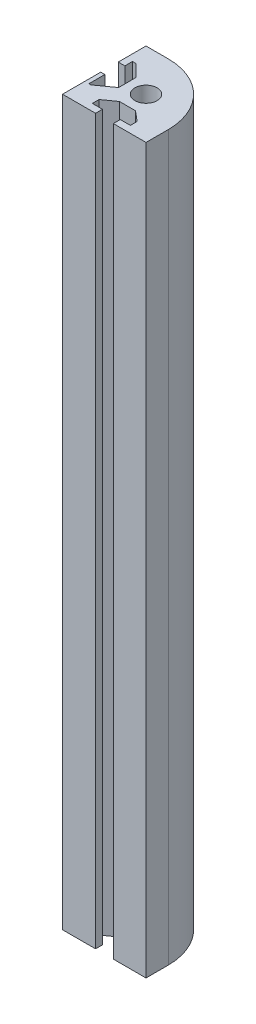
ISO-10303-21;
HEADER;
FILE_DESCRIPTION(('STEP AP214'),'2;1');
FILE_NAME('part.step','',(''),(''),'','','');
FILE_SCHEMA(('AUTOMOTIVE_DESIGN { 1 0 10303 214 1 1 1 1 }'));
ENDSEC;
DATA;
#1=APPLICATION_CONTEXT('core data for automotive mechanical design processes');
#2=APPLICATION_PROTOCOL_DEFINITION('international standard','automotive_design',2000,#1);
#3=PRODUCT_CONTEXT('',#1,'mechanical');
#4=PRODUCT('Part','Part','',(#3));
#5=PRODUCT_RELATED_PRODUCT_CATEGORY('part','',(#4));
#6=PRODUCT_DEFINITION_FORMATION('','',#4);
#7=PRODUCT_DEFINITION_CONTEXT('part definition',#1,'design');
#8=PRODUCT_DEFINITION('design','',#6,#7);
#9=PRODUCT_DEFINITION_SHAPE('','',#8);
#10=(LENGTH_UNIT() NAMED_UNIT(*) SI_UNIT(.MILLI.,.METRE.));
#11=(NAMED_UNIT(*) PLANE_ANGLE_UNIT() SI_UNIT($,.RADIAN.));
#12=(NAMED_UNIT(*) SI_UNIT($,.STERADIAN.) SOLID_ANGLE_UNIT());
#13=UNCERTAINTY_MEASURE_WITH_UNIT(LENGTH_MEASURE(1.E-05),#10,'distance_accuracy_value','');
#14=(GEOMETRIC_REPRESENTATION_CONTEXT(3) GLOBAL_UNCERTAINTY_ASSIGNED_CONTEXT((#13)) GLOBAL_UNIT_ASSIGNED_CONTEXT((#10,
#11,#12)) REPRESENTATION_CONTEXT('',''));
#15=CARTESIAN_POINT('',(0.,0.,0.));
#16=DIRECTION('',(0.,0.,1.));
#17=DIRECTION('',(1.,0.,0.));
#18=AXIS2_PLACEMENT_3D('',#15,#16,#17);
#19=CARTESIAN_POINT('',(-7.,260.,7.));
#20=DIRECTION('',(0.,-1.,0.));
#21=DIRECTION('',(0.,0.,-1.));
#22=AXIS2_PLACEMENT_3D('',#19,#20,#21);
#23=PLANE('',#22);
#24=DIRECTION('',(0.,0.,-1.));
#25=VECTOR('',#24,1.);
#26=CARTESIAN_POINT('',(15.,260.,15.));
#27=LINE('',#26,#25);
#28=CARTESIAN_POINT('',(15.,260.,15.));
#29=VERTEX_POINT('',#28);
#30=CARTESIAN_POINT('',(15.,260.,7.));
#31=VERTEX_POINT('',#30);
#32=EDGE_CURVE('E369',#29,#31,#27,.T.);
#33=ORIENTED_EDGE('',*,*,#32,.T.);
#34=CARTESIAN_POINT('',(-7.,260.,7.));
#35=DIRECTION('',(0.,1.,0.));
#36=DIRECTION('',(0.,0.,-1.));
#37=AXIS2_PLACEMENT_3D('',#34,#35,#36);
#38=CIRCLE('',#37,22.);
#39=CARTESIAN_POINT('',(-7.00000000000001,260.,-15.));
#40=VERTEX_POINT('',#39);
#41=EDGE_CURVE('E181',#31,#40,#38,.T.);
#42=ORIENTED_EDGE('',*,*,#41,.T.);
#43=DIRECTION('',(-1.,0.,0.));
#44=VECTOR('',#43,1.);
#45=CARTESIAN_POINT('',(-7.00000000000001,260.,-15.));
#46=LINE('',#45,#44);
#47=CARTESIAN_POINT('',(-15.,260.,-15.));
#48=VERTEX_POINT('',#47);
#49=EDGE_CURVE('E458',#40,#48,#46,.T.);
#50=ORIENTED_EDGE('',*,*,#49,.T.);
#51=DIRECTION('',(0.,0.,1.));
#52=VECTOR('',#51,1.);
#53=CARTESIAN_POINT('',(-15.,260.,-15.));
#54=LINE('',#53,#52);
#55=CARTESIAN_POINT('',(-15.,260.,-5.02760491674106));
#56=VERTEX_POINT('',#55);
#57=EDGE_CURVE('E478',#48,#56,#54,.T.);
#58=ORIENTED_EDGE('',*,*,#57,.T.);
#59=DIRECTION('',(1.,0.,0.));
#60=VECTOR('',#59,1.);
#61=CARTESIAN_POINT('',(-15.,260.,-5.02760491674106));
#62=LINE('',#61,#60);
#63=CARTESIAN_POINT('',(-12.62343706875,260.,-5.02760491674106));
#64=VERTEX_POINT('',#63);
#65=EDGE_CURVE('E474',#56,#64,#62,.T.);
#66=ORIENTED_EDGE('',*,*,#65,.T.);
#67=DIRECTION('',(0.,0.,-1.));
#68=VECTOR('',#67,1.);
#69=CARTESIAN_POINT('',(-12.62343706875,260.,-5.02760491674106));
#70=LINE('',#69,#68);
#71=CARTESIAN_POINT('',(-12.62343706875,260.,-7.75268234050665));
#72=VERTEX_POINT('',#71);
#73=EDGE_CURVE('E477',#64,#72,#70,.T.);
#74=ORIENTED_EDGE('',*,*,#73,.T.);
#75=DIRECTION('',(1.,0.,0.));
#76=VECTOR('',#75,1.);
#77=CARTESIAN_POINT('',(-12.62343706875,260.,-7.75268234050665));
#78=LINE('',#77,#76);
#79=CARTESIAN_POINT('',(-11.3205484379823,260.,-7.75268234050665));
#80=VERTEX_POINT('',#79);
#81=EDGE_CURVE('E483',#72,#80,#78,.T.);
#82=ORIENTED_EDGE('',*,*,#81,.T.);
#83=DIRECTION('',(0.707106781186548,0.,0.707106781186548));
#84=VECTOR('',#83,1.);
#85=CARTESIAN_POINT('',(-11.3205484379823,260.,-7.75268234050665));
#86=LINE('',#85,#84);
#87=CARTESIAN_POINT('',(-7.,260.,-3.43213390252437));
#88=VERTEX_POINT('',#87);
#89=EDGE_CURVE('E491',#80,#88,#86,.T.);
#90=ORIENTED_EDGE('',*,*,#89,.T.);
#91=DIRECTION('',(0.,0.,1.));
#92=VECTOR('',#91,1.);
#93=CARTESIAN_POINT('',(-7.,260.,-3.43213390252437));
#94=LINE('',#93,#92);
#95=CARTESIAN_POINT('',(-7.,260.,2.8610903108259));
#96=VERTEX_POINT('',#95);
#97=EDGE_CURVE('E494',#88,#96,#94,.T.);
#98=ORIENTED_EDGE('',*,*,#97,.T.);
#99=DIRECTION('',(-0.813663912579942,0.,0.581335563478702));
#100=VECTOR('',#99,1.);
#101=CARTESIAN_POINT('',(-7.,260.,2.8610903108259));
#102=LINE('',#101,#100);
#103=CARTESIAN_POINT('',(-12.793007796317,260.,7.00000000000001));
#104=VERTEX_POINT('',#103);
#105=EDGE_CURVE('E497',#96,#104,#102,.T.);
#106=ORIENTED_EDGE('',*,*,#105,.T.);
#107=DIRECTION('',(-1.,0.,0.));
#108=VECTOR('',#107,1.);
#109=CARTESIAN_POINT('',(-12.793007796317,260.,7.00000000000001));
#110=LINE('',#109,#108);
#111=CARTESIAN_POINT('',(-13.5272861174793,260.,7.00000000000001));
#112=VERTEX_POINT('',#111);
#113=EDGE_CURVE('E499',#104,#112,#110,.T.);
#114=ORIENTED_EDGE('',*,*,#113,.T.);
#115=DIRECTION('',(0.,0.,-1.));
#116=VECTOR('',#115,1.);
#117=CARTESIAN_POINT('',(-13.5272861174793,260.,7.00000000000001));
#118=LINE('',#117,#116);
#119=CARTESIAN_POINT('',(-13.5272861174793,260.,1.25796789040179));
#120=VERTEX_POINT('',#119);
#121=EDGE_CURVE('E502',#112,#120,#118,.T.);
#122=ORIENTED_EDGE('',*,*,#121,.T.);
#123=DIRECTION('',(-1.,0.,0.));
#124=VECTOR('',#123,1.);
#125=CARTESIAN_POINT('',(-13.5272861174793,260.,1.25796789040179));
#126=LINE('',#125,#124);
#127=CARTESIAN_POINT('',(-15.,260.,1.25796789040179));
#128=VERTEX_POINT('',#127);
#129=EDGE_CURVE('E505',#120,#128,#126,.T.);
#130=ORIENTED_EDGE('',*,*,#129,.T.);
#131=DIRECTION('',(0.,0.,1.));
#132=VECTOR('',#131,1.);
#133=CARTESIAN_POINT('',(-15.,260.,1.25796789040179));
#134=LINE('',#133,#132);
#135=CARTESIAN_POINT('',(-15.,260.,15.));
#136=VERTEX_POINT('',#135);
#137=EDGE_CURVE('E508',#128,#136,#134,.T.);
#138=ORIENTED_EDGE('',*,*,#137,.T.);
#139=DIRECTION('',(1.,0.,0.));
#140=VECTOR('',#139,1.);
#141=CARTESIAN_POINT('',(-15.,260.,15.));
#142=LINE('',#141,#140);
#143=CARTESIAN_POINT('',(-3.13994125446428,260.,15.));
#144=VERTEX_POINT('',#143);
#145=EDGE_CURVE('E511',#136,#144,#142,.T.);
#146=ORIENTED_EDGE('',*,*,#145,.T.);
#147=DIRECTION('',(0.,0.,-1.));
#148=VECTOR('',#147,1.);
#149=CARTESIAN_POINT('',(-3.13994125446428,260.,15.));
#150=LINE('',#149,#148);
#151=CARTESIAN_POINT('',(-3.13994125446428,260.,12.5058350189732));
#152=VERTEX_POINT('',#151);
#153=EDGE_CURVE('E514',#144,#152,#150,.T.);
#154=ORIENTED_EDGE('',*,*,#153,.T.);
#155=DIRECTION('',(-1.,0.,0.));
#156=VECTOR('',#155,1.);
#157=CARTESIAN_POINT('',(-3.13994125446428,260.,12.5058350189732));
#158=LINE('',#157,#156);
#159=CARTESIAN_POINT('',(-6.77895709017856,260.,12.5058350189732));
#160=VERTEX_POINT('',#159);
#161=EDGE_CURVE('E516',#152,#160,#158,.T.);
#162=ORIENTED_EDGE('',*,*,#161,.T.);
#163=DIRECTION('',(0.,0.,-1.));
#164=VECTOR('',#163,1.);
#165=CARTESIAN_POINT('',(-6.77895709017856,260.,12.5058350189732));
#166=LINE('',#165,#164);
#167=CARTESIAN_POINT('',(-6.77895709017856,260.,10.0798244618304));
#168=VERTEX_POINT('',#167);
#169=EDGE_CURVE('E519',#160,#168,#166,.T.);
#170=ORIENTED_EDGE('',*,*,#169,.T.);
#171=DIRECTION('',(0.813663912579942,0.,-0.581335563478702));
#172=VECTOR('',#171,1.);
#173=CARTESIAN_POINT('',(-6.77895709017856,260.,10.0798244618304));
#174=LINE('',#173,#172);
#175=CARTESIAN_POINT('',(-2.51290963769489,260.,7.03187670198325));
#176=VERTEX_POINT('',#175);
#177=EDGE_CURVE('E522',#168,#176,#174,.T.);
#178=ORIENTED_EDGE('',*,*,#177,.T.);
#179=DIRECTION('',(1.,0.,0.));
#180=VECTOR('',#179,1.);
#181=CARTESIAN_POINT('',(-2.51290963769489,260.,7.03187670198325));
#182=LINE('',#181,#180);
#183=CARTESIAN_POINT('',(3.25590475982143,260.,7.03187670198325));
#184=VERTEX_POINT('',#183);
#185=EDGE_CURVE('E525',#176,#184,#182,.T.);
#186=ORIENTED_EDGE('',*,*,#185,.T.);
#187=DIRECTION('',(0.766619760050027,0.,0.642101349866857));
#188=VECTOR('',#187,1.);
#189=CARTESIAN_POINT('',(3.25590475982143,260.,7.03187670198325));
#190=LINE('',#189,#188);
#191=CARTESIAN_POINT('',(6.89492059553572,260.,10.0798244618304));
#192=VERTEX_POINT('',#191);
#193=EDGE_CURVE('E528',#184,#192,#190,.T.);
#194=ORIENTED_EDGE('',*,*,#193,.T.);
#195=DIRECTION('',(0.,0.,1.));
#196=VECTOR('',#195,1.);
#197=CARTESIAN_POINT('',(6.89492059553572,260.,10.0798244618304));
#198=LINE('',#197,#196);
#199=CARTESIAN_POINT('',(6.89492059553572,260.,12.5058350189732));
#200=VERTEX_POINT('',#199);
#201=EDGE_CURVE('E272',#192,#200,#198,.T.);
#202=ORIENTED_EDGE('',*,*,#201,.T.);
#203=DIRECTION('',(-1.,0.,0.));
#204=VECTOR('',#203,1.);
#205=CARTESIAN_POINT('',(6.89492059553572,260.,12.5058350189732));
#206=LINE('',#205,#204);
#207=CARTESIAN_POINT('',(3.25590475982143,260.,12.5058350189732));
#208=VERTEX_POINT('',#207);
#209=EDGE_CURVE('E266',#200,#208,#206,.T.);
#210=ORIENTED_EDGE('',*,*,#209,.T.);
#211=DIRECTION('',(0.,0.,1.));
#212=VECTOR('',#211,1.);
#213=CARTESIAN_POINT('',(3.25590475982143,260.,12.5058350189732));
#214=LINE('',#213,#212);
#215=CARTESIAN_POINT('',(3.25590475982143,260.,15.));
#216=VERTEX_POINT('',#215);
#217=EDGE_CURVE('E270',#208,#216,#214,.T.);
#218=ORIENTED_EDGE('',*,*,#217,.T.);
#219=DIRECTION('',(1.,0.,0.));
#220=VECTOR('',#219,1.);
#221=CARTESIAN_POINT('',(3.25590475982143,260.,15.));
#222=LINE('',#221,#220);
#223=EDGE_CURVE('E61',#216,#29,#222,.T.);
#224=ORIENTED_EDGE('',*,*,#223,.T.);
#225=EDGE_LOOP('',(#33,#42,#50,#58,#66,#74,#82,#90,#98,#106,#114,#122,#130,#138,#146,#154,#162,
#170,#178,#186,#194,#202,#210,#218,#224));
#226=FACE_BOUND('',#225,.T.);
#227=CARTESIAN_POINT('',(0.,260.,0.));
#228=DIRECTION('',(0.,1.,0.));
#229=DIRECTION('',(0.,0.,1.));
#230=AXIS2_PLACEMENT_3D('',#227,#228,#229);
#231=CIRCLE('',#230,4.);
#232=CARTESIAN_POINT('',(0.,260.,4.));
#233=VERTEX_POINT('',#232);
#234=EDGE_CURVE('E300',#233,#233,#231,.T.);
#235=ORIENTED_EDGE('',*,*,#234,.F.);
#236=EDGE_LOOP('',(#235));
#237=FACE_BOUND('',#236,.T.);
#238=ADVANCED_FACE('F40',(#226,#237),#23,.F.);
#239=CARTESIAN_POINT('',(-7.,0.,7.));
#240=DIRECTION('',(0.,-1.,0.));
#241=DIRECTION('',(0.,0.,-1.));
#242=AXIS2_PLACEMENT_3D('',#239,#240,#241);
#243=PLANE('',#242);
#244=DIRECTION('',(0.,0.,-1.));
#245=VECTOR('',#244,1.);
#246=CARTESIAN_POINT('',(15.,0.,15.));
#247=LINE('',#246,#245);
#248=CARTESIAN_POINT('',(15.,0.,15.));
#249=VERTEX_POINT('',#248);
#250=CARTESIAN_POINT('',(15.,0.,7.));
#251=VERTEX_POINT('',#250);
#252=EDGE_CURVE('E295',#249,#251,#247,.T.);
#253=ORIENTED_EDGE('',*,*,#252,.F.);
#254=DIRECTION('',(1.,0.,0.));
#255=VECTOR('',#254,1.);
#256=CARTESIAN_POINT('',(3.25590475982143,0.,15.));
#257=LINE('',#256,#255);
#258=CARTESIAN_POINT('',(3.25590475982143,0.,15.));
#259=VERTEX_POINT('',#258);
#260=EDGE_CURVE('E173',#259,#249,#257,.T.);
#261=ORIENTED_EDGE('',*,*,#260,.F.);
#262=DIRECTION('',(0.,0.,1.));
#263=VECTOR('',#262,1.);
#264=CARTESIAN_POINT('',(3.25590475982143,0.,12.5058350189732));
#265=LINE('',#264,#263);
#266=CARTESIAN_POINT('',(3.25590475982143,0.,12.5058350189732));
#267=VERTEX_POINT('',#266);
#268=EDGE_CURVE('E166',#267,#259,#265,.T.);
#269=ORIENTED_EDGE('',*,*,#268,.F.);
#270=DIRECTION('',(-1.,0.,0.));
#271=VECTOR('',#270,1.);
#272=CARTESIAN_POINT('',(6.89492059553572,0.,12.5058350189732));
#273=LINE('',#272,#271);
#274=CARTESIAN_POINT('',(6.89492059553572,0.,12.5058350189732));
#275=VERTEX_POINT('',#274);
#276=EDGE_CURVE('E281',#275,#267,#273,.T.);
#277=ORIENTED_EDGE('',*,*,#276,.F.);
#278=DIRECTION('',(0.,0.,1.));
#279=VECTOR('',#278,1.);
#280=CARTESIAN_POINT('',(6.89492059553572,0.,10.0798244618304));
#281=LINE('',#280,#279);
#282=CARTESIAN_POINT('',(6.89492059553572,0.,10.0798244618304));
#283=VERTEX_POINT('',#282);
#284=EDGE_CURVE('E360',#283,#275,#281,.T.);
#285=ORIENTED_EDGE('',*,*,#284,.F.);
#286=DIRECTION('',(0.766619760050027,0.,0.642101349866857));
#287=VECTOR('',#286,1.);
#288=CARTESIAN_POINT('',(3.25590475982143,0.,7.03187670198325));
#289=LINE('',#288,#287);
#290=CARTESIAN_POINT('',(3.25590475982143,0.,7.03187670198325));
#291=VERTEX_POINT('',#290);
#292=EDGE_CURVE('E357',#291,#283,#289,.T.);
#293=ORIENTED_EDGE('',*,*,#292,.F.);
#294=DIRECTION('',(1.,0.,0.));
#295=VECTOR('',#294,1.);
#296=CARTESIAN_POINT('',(-2.51290963769489,0.,7.03187670198325));
#297=LINE('',#296,#295);
#298=CARTESIAN_POINT('',(-2.51290963769489,0.,7.03187670198325));
#299=VERTEX_POINT('',#298);
#300=EDGE_CURVE('E354',#299,#291,#297,.T.);
#301=ORIENTED_EDGE('',*,*,#300,.F.);
#302=DIRECTION('',(0.813663912579942,0.,-0.581335563478702));
#303=VECTOR('',#302,1.);
#304=CARTESIAN_POINT('',(-6.77895709017856,0.,10.0798244618304));
#305=LINE('',#304,#303);
#306=CARTESIAN_POINT('',(-6.77895709017856,0.,10.0798244618304));
#307=VERTEX_POINT('',#306);
#308=EDGE_CURVE('E351',#307,#299,#305,.T.);
#309=ORIENTED_EDGE('',*,*,#308,.F.);
#310=DIRECTION('',(0.,0.,-1.));
#311=VECTOR('',#310,1.);
#312=CARTESIAN_POINT('',(-6.77895709017856,0.,12.5058350189732));
#313=LINE('',#312,#311);
#314=CARTESIAN_POINT('',(-6.77895709017856,0.,12.5058350189732));
#315=VERTEX_POINT('',#314);
#316=EDGE_CURVE('E348',#315,#307,#313,.T.);
#317=ORIENTED_EDGE('',*,*,#316,.F.);
#318=DIRECTION('',(-1.,0.,0.));
#319=VECTOR('',#318,1.);
#320=CARTESIAN_POINT('',(-3.13994125446428,0.,12.5058350189732));
#321=LINE('',#320,#319);
#322=CARTESIAN_POINT('',(-3.13994125446428,0.,12.5058350189732));
#323=VERTEX_POINT('',#322);
#324=EDGE_CURVE('E345',#323,#315,#321,.T.);
#325=ORIENTED_EDGE('',*,*,#324,.F.);
#326=DIRECTION('',(0.,0.,-1.));
#327=VECTOR('',#326,1.);
#328=CARTESIAN_POINT('',(-3.13994125446428,0.,15.));
#329=LINE('',#328,#327);
#330=CARTESIAN_POINT('',(-3.13994125446428,0.,15.));
#331=VERTEX_POINT('',#330);
#332=EDGE_CURVE('E342',#331,#323,#329,.T.);
#333=ORIENTED_EDGE('',*,*,#332,.F.);
#334=DIRECTION('',(1.,0.,0.));
#335=VECTOR('',#334,1.);
#336=CARTESIAN_POINT('',(-15.,0.,15.));
#337=LINE('',#336,#335);
#338=CARTESIAN_POINT('',(-15.,0.,15.));
#339=VERTEX_POINT('',#338);
#340=EDGE_CURVE('E339',#339,#331,#337,.T.);
#341=ORIENTED_EDGE('',*,*,#340,.F.);
#342=DIRECTION('',(0.,0.,1.));
#343=VECTOR('',#342,1.);
#344=CARTESIAN_POINT('',(-15.,0.,1.25796789040179));
#345=LINE('',#344,#343);
#346=CARTESIAN_POINT('',(-15.,0.,1.25796789040179));
#347=VERTEX_POINT('',#346);
#348=EDGE_CURVE('E336',#347,#339,#345,.T.);
#349=ORIENTED_EDGE('',*,*,#348,.F.);
#350=DIRECTION('',(-1.,0.,0.));
#351=VECTOR('',#350,1.);
#352=CARTESIAN_POINT('',(-13.5272861174793,0.,1.25796789040179));
#353=LINE('',#352,#351);
#354=CARTESIAN_POINT('',(-13.5272861174793,0.,1.25796789040179));
#355=VERTEX_POINT('',#354);
#356=EDGE_CURVE('E333',#355,#347,#353,.T.);
#357=ORIENTED_EDGE('',*,*,#356,.F.);
#358=DIRECTION('',(0.,0.,-1.));
#359=VECTOR('',#358,1.);
#360=CARTESIAN_POINT('',(-13.5272861174793,0.,7.00000000000001));
#361=LINE('',#360,#359);
#362=CARTESIAN_POINT('',(-13.5272861174793,0.,7.00000000000001));
#363=VERTEX_POINT('',#362);
#364=EDGE_CURVE('E330',#363,#355,#361,.T.);
#365=ORIENTED_EDGE('',*,*,#364,.F.);
#366=DIRECTION('',(-1.,0.,0.));
#367=VECTOR('',#366,1.);
#368=CARTESIAN_POINT('',(-12.793007796317,0.,7.00000000000001));
#369=LINE('',#368,#367);
#370=CARTESIAN_POINT('',(-12.793007796317,0.,7.00000000000001));
#371=VERTEX_POINT('',#370);
#372=EDGE_CURVE('E327',#371,#363,#369,.T.);
#373=ORIENTED_EDGE('',*,*,#372,.F.);
#374=DIRECTION('',(-0.813663912579942,0.,0.581335563478702));
#375=VECTOR('',#374,1.);
#376=CARTESIAN_POINT('',(-7.,0.,2.8610903108259));
#377=LINE('',#376,#375);
#378=CARTESIAN_POINT('',(-7.,0.,2.8610903108259));
#379=VERTEX_POINT('',#378);
#380=EDGE_CURVE('E324',#379,#371,#377,.T.);
#381=ORIENTED_EDGE('',*,*,#380,.F.);
#382=DIRECTION('',(0.,0.,1.));
#383=VECTOR('',#382,1.);
#384=CARTESIAN_POINT('',(-7.,0.,-3.43213390252437));
#385=LINE('',#384,#383);
#386=CARTESIAN_POINT('',(-7.,0.,-3.43213390252437));
#387=VERTEX_POINT('',#386);
#388=EDGE_CURVE('E321',#387,#379,#385,.T.);
#389=ORIENTED_EDGE('',*,*,#388,.F.);
#390=DIRECTION('',(0.707106781186548,0.,0.707106781186548));
#391=VECTOR('',#390,1.);
#392=CARTESIAN_POINT('',(-11.3205484379823,0.,-7.75268234050665));
#393=LINE('',#392,#391);
#394=CARTESIAN_POINT('',(-11.3205484379823,0.,-7.75268234050665));
#395=VERTEX_POINT('',#394);
#396=EDGE_CURVE('E318',#395,#387,#393,.T.);
#397=ORIENTED_EDGE('',*,*,#396,.F.);
#398=DIRECTION('',(1.,0.,0.));
#399=VECTOR('',#398,1.);
#400=CARTESIAN_POINT('',(-12.62343706875,0.,-7.75268234050665));
#401=LINE('',#400,#399);
#402=CARTESIAN_POINT('',(-12.62343706875,0.,-7.75268234050665));
#403=VERTEX_POINT('',#402);
#404=EDGE_CURVE('E315',#403,#395,#401,.T.);
#405=ORIENTED_EDGE('',*,*,#404,.F.);
#406=DIRECTION('',(0.,0.,-1.));
#407=VECTOR('',#406,1.);
#408=CARTESIAN_POINT('',(-12.62343706875,0.,-5.02760491674106));
#409=LINE('',#408,#407);
#410=CARTESIAN_POINT('',(-12.62343706875,0.,-5.02760491674106));
#411=VERTEX_POINT('',#410);
#412=EDGE_CURVE('E312',#411,#403,#409,.T.);
#413=ORIENTED_EDGE('',*,*,#412,.F.);
#414=DIRECTION('',(1.,0.,0.));
#415=VECTOR('',#414,1.);
#416=CARTESIAN_POINT('',(-15.,0.,-5.02760491674106));
#417=LINE('',#416,#415);
#418=CARTESIAN_POINT('',(-15.,0.,-5.02760491674106));
#419=VERTEX_POINT('',#418);
#420=EDGE_CURVE('E309',#419,#411,#417,.T.);
#421=ORIENTED_EDGE('',*,*,#420,.F.);
#422=DIRECTION('',(0.,0.,1.));
#423=VECTOR('',#422,1.);
#424=CARTESIAN_POINT('',(-15.,0.,-15.));
#425=LINE('',#424,#423);
#426=CARTESIAN_POINT('',(-15.,0.,-15.));
#427=VERTEX_POINT('',#426);
#428=EDGE_CURVE('E306',#427,#419,#425,.T.);
#429=ORIENTED_EDGE('',*,*,#428,.F.);
#430=DIRECTION('',(-1.,0.,0.));
#431=VECTOR('',#430,1.);
#432=CARTESIAN_POINT('',(-7.00000000000001,0.,-15.));
#433=LINE('',#432,#431);
#434=CARTESIAN_POINT('',(-7.00000000000001,0.,-15.));
#435=VERTEX_POINT('',#434);
#436=EDGE_CURVE('E303',#435,#427,#433,.T.);
#437=ORIENTED_EDGE('',*,*,#436,.F.);
#438=CARTESIAN_POINT('',(-7.,0.,7.));
#439=DIRECTION('',(0.,1.,0.));
#440=DIRECTION('',(0.,0.,-1.));
#441=AXIS2_PLACEMENT_3D('',#438,#439,#440);
#442=CIRCLE('',#441,22.);
#443=EDGE_CURVE('E299',#251,#435,#442,.T.);
#444=ORIENTED_EDGE('',*,*,#443,.F.);
#445=EDGE_LOOP('',(#253,#261,#269,#277,#285,#293,#301,#309,#317,#325,#333,#341,#349,#357,#365,
#373,#381,#389,#397,#405,#413,#421,#429,#437,#444));
#446=FACE_BOUND('',#445,.T.);
#447=CARTESIAN_POINT('',(0.,0.,0.));
#448=DIRECTION('',(0.,1.,0.));
#449=DIRECTION('',(0.,0.,1.));
#450=AXIS2_PLACEMENT_3D('',#447,#448,#449);
#451=CIRCLE('',#450,4.);
#452=CARTESIAN_POINT('',(0.,0.,4.));
#453=VERTEX_POINT('',#452);
#454=EDGE_CURVE('E534',#453,#453,#451,.T.);
#455=ORIENTED_EDGE('',*,*,#454,.T.);
#456=EDGE_LOOP('',(#455));
#457=FACE_BOUND('',#456,.T.);
#458=ADVANCED_FACE('F462',(#446,#457),#243,.T.);
#459=CARTESIAN_POINT('',(15.,260.,15.));
#460=DIRECTION('',(-1.,0.,0.));
#461=DIRECTION('',(0.,0.,1.));
#462=AXIS2_PLACEMENT_3D('',#459,#460,#461);
#463=PLANE('',#462);
#464=ORIENTED_EDGE('',*,*,#252,.T.);
#465=DIRECTION('',(0.,-1.,0.));
#466=VECTOR('',#465,1.);
#467=CARTESIAN_POINT('',(15.,260.,7.));
#468=LINE('',#467,#466);
#469=EDGE_CURVE('E11',#31,#251,#468,.T.);
#470=ORIENTED_EDGE('',*,*,#469,.F.);
#471=ORIENTED_EDGE('',*,*,#32,.F.);
#472=DIRECTION('',(0.,-1.,0.));
#473=VECTOR('',#472,1.);
#474=CARTESIAN_POINT('',(15.,260.,15.));
#475=LINE('',#474,#473);
#476=EDGE_CURVE('E291',#29,#249,#475,.T.);
#477=ORIENTED_EDGE('',*,*,#476,.T.);
#478=EDGE_LOOP('',(#464,#470,#471,#477));
#479=FACE_BOUND('',#478,.T.);
#480=ADVANCED_FACE('F42',(#479),#463,.F.);
#481=CARTESIAN_POINT('',(-7.,260.,7.));
#482=DIRECTION('',(0.,-1.,0.));
#483=DIRECTION('',(0.,0.,-1.));
#484=AXIS2_PLACEMENT_3D('',#481,#482,#483);
#485=CYLINDRICAL_SURFACE('',#484,22.);
#486=ORIENTED_EDGE('',*,*,#443,.T.);
#487=DIRECTION('',(0.,-1.,0.));
#488=VECTOR('',#487,1.);
#489=CARTESIAN_POINT('',(-7.00000000000001,260.,-15.));
#490=LINE('',#489,#488);
#491=EDGE_CURVE('E50',#40,#435,#490,.T.);
#492=ORIENTED_EDGE('',*,*,#491,.F.);
#493=ORIENTED_EDGE('',*,*,#41,.F.);
#494=ORIENTED_EDGE('',*,*,#469,.T.);
#495=EDGE_LOOP('',(#486,#492,#493,#494));
#496=FACE_BOUND('',#495,.T.);
#497=ADVANCED_FACE('F639',(#496),#485,.T.);
#498=CARTESIAN_POINT('',(-7.00000000000001,260.,-15.));
#499=DIRECTION('',(0.,0.,1.));
#500=DIRECTION('',(1.,0.,0.));
#501=AXIS2_PLACEMENT_3D('',#498,#499,#500);
#502=PLANE('',#501);
#503=ORIENTED_EDGE('',*,*,#436,.T.);
#504=DIRECTION('',(0.,-1.,0.));
#505=VECTOR('',#504,1.);
#506=CARTESIAN_POINT('',(-15.,260.,-15.));
#507=LINE('',#506,#505);
#508=EDGE_CURVE('E447',#48,#427,#507,.T.);
#509=ORIENTED_EDGE('',*,*,#508,.F.);
#510=ORIENTED_EDGE('',*,*,#49,.F.);
#511=ORIENTED_EDGE('',*,*,#491,.T.);
#512=EDGE_LOOP('',(#503,#509,#510,#511));
#513=FACE_BOUND('',#512,.T.);
#514=ADVANCED_FACE('F456',(#513),#502,.F.);
#515=CARTESIAN_POINT('',(-15.,260.,-15.));
#516=DIRECTION('',(1.,0.,0.));
#517=DIRECTION('',(0.,0.,-1.));
#518=AXIS2_PLACEMENT_3D('',#515,#516,#517);
#519=PLANE('',#518);
#520=ORIENTED_EDGE('',*,*,#428,.T.);
#521=DIRECTION('',(0.,-1.,0.));
#522=VECTOR('',#521,1.);
#523=CARTESIAN_POINT('',(-15.,260.,-5.02760491674106));
#524=LINE('',#523,#522);
#525=EDGE_CURVE('E443',#56,#419,#524,.T.);
#526=ORIENTED_EDGE('',*,*,#525,.F.);
#527=ORIENTED_EDGE('',*,*,#57,.F.);
#528=ORIENTED_EDGE('',*,*,#508,.T.);
#529=EDGE_LOOP('',(#520,#526,#527,#528));
#530=FACE_BOUND('',#529,.T.);
#531=ADVANCED_FACE('F468',(#530),#519,.F.);
#532=CARTESIAN_POINT('',(-15.,260.,-5.02760491674106));
#533=DIRECTION('',(0.,0.,-1.));
#534=DIRECTION('',(-1.,0.,0.));
#535=AXIS2_PLACEMENT_3D('',#532,#533,#534);
#536=PLANE('',#535);
#537=ORIENTED_EDGE('',*,*,#420,.T.);
#538=DIRECTION('',(0.,-1.,0.));
#539=VECTOR('',#538,1.);
#540=CARTESIAN_POINT('',(-12.62343706875,260.,-5.02760491674106));
#541=LINE('',#540,#539);
#542=EDGE_CURVE('E439',#64,#411,#541,.T.);
#543=ORIENTED_EDGE('',*,*,#542,.F.);
#544=ORIENTED_EDGE('',*,*,#65,.F.);
#545=ORIENTED_EDGE('',*,*,#525,.T.);
#546=EDGE_LOOP('',(#537,#543,#544,#545));
#547=FACE_BOUND('',#546,.T.);
#548=ADVANCED_FACE('F472',(#547),#536,.F.);
#549=CARTESIAN_POINT('',(-12.62343706875,260.,-5.02760491674106));
#550=DIRECTION('',(-1.,0.,0.));
#551=DIRECTION('',(0.,0.,1.));
#552=AXIS2_PLACEMENT_3D('',#549,#550,#551);
#553=PLANE('',#552);
#554=ORIENTED_EDGE('',*,*,#412,.T.);
#555=DIRECTION('',(0.,-1.,0.));
#556=VECTOR('',#555,1.);
#557=CARTESIAN_POINT('',(-12.62343706875,260.,-7.75268234050665));
#558=LINE('',#557,#556);
#559=EDGE_CURVE('E435',#72,#403,#558,.T.);
#560=ORIENTED_EDGE('',*,*,#559,.F.);
#561=ORIENTED_EDGE('',*,*,#73,.F.);
#562=ORIENTED_EDGE('',*,*,#542,.T.);
#563=EDGE_LOOP('',(#554,#560,#561,#562));
#564=FACE_BOUND('',#563,.T.);
#565=ADVANCED_FACE('F629',(#564),#553,.F.);
#566=CARTESIAN_POINT('',(-12.62343706875,260.,-7.75268234050665));
#567=DIRECTION('',(0.,0.,-1.));
#568=DIRECTION('',(-1.,0.,0.));
#569=AXIS2_PLACEMENT_3D('',#566,#567,#568);
#570=PLANE('',#569);
#571=ORIENTED_EDGE('',*,*,#404,.T.);
#572=DIRECTION('',(0.,-1.,0.));
#573=VECTOR('',#572,1.);
#574=CARTESIAN_POINT('',(-11.3205484379823,260.,-7.75268234050665));
#575=LINE('',#574,#573);
#576=EDGE_CURVE('E431',#80,#395,#575,.T.);
#577=ORIENTED_EDGE('',*,*,#576,.F.);
#578=ORIENTED_EDGE('',*,*,#81,.F.);
#579=ORIENTED_EDGE('',*,*,#559,.T.);
#580=EDGE_LOOP('',(#571,#577,#578,#579));
#581=FACE_BOUND('',#580,.T.);
#582=ADVANCED_FACE('F625',(#581),#570,.F.);
#583=CARTESIAN_POINT('',(-11.3205484379823,260.,-7.75268234050665));
#584=DIRECTION('',(0.707106781186548,0.,-0.707106781186548));
#585=DIRECTION('',(-0.707106781186548,0.,-0.707106781186548));
#586=AXIS2_PLACEMENT_3D('',#583,#584,#585);
#587=PLANE('',#586);
#588=ORIENTED_EDGE('',*,*,#396,.T.);
#589=DIRECTION('',(0.,-1.,0.));
#590=VECTOR('',#589,1.);
#591=CARTESIAN_POINT('',(-7.,260.,-3.43213390252437));
#592=LINE('',#591,#590);
#593=EDGE_CURVE('E427',#88,#387,#592,.T.);
#594=ORIENTED_EDGE('',*,*,#593,.F.);
#595=ORIENTED_EDGE('',*,*,#89,.F.);
#596=ORIENTED_EDGE('',*,*,#576,.T.);
#597=EDGE_LOOP('',(#588,#594,#595,#596));
#598=FACE_BOUND('',#597,.T.);
#599=ADVANCED_FACE('F621',(#598),#587,.F.);
#600=CARTESIAN_POINT('',(-7.,260.,-3.43213390252437));
#601=DIRECTION('',(1.,0.,0.));
#602=DIRECTION('',(0.,0.,-1.));
#603=AXIS2_PLACEMENT_3D('',#600,#601,#602);
#604=PLANE('',#603);
#605=ORIENTED_EDGE('',*,*,#388,.T.);
#606=DIRECTION('',(0.,-1.,0.));
#607=VECTOR('',#606,1.);
#608=CARTESIAN_POINT('',(-7.,260.,2.8610903108259));
#609=LINE('',#608,#607);
#610=EDGE_CURVE('E423',#96,#379,#609,.T.);
#611=ORIENTED_EDGE('',*,*,#610,.F.);
#612=ORIENTED_EDGE('',*,*,#97,.F.);
#613=ORIENTED_EDGE('',*,*,#593,.T.);
#614=EDGE_LOOP('',(#605,#611,#612,#613));
#615=FACE_BOUND('',#614,.T.);
#616=ADVANCED_FACE('F617',(#615),#604,.F.);
#617=CARTESIAN_POINT('',(-7.,260.,2.8610903108259));
#618=DIRECTION('',(0.581335563478702,0.,0.813663912579942));
#619=DIRECTION('',(0.813663912579942,0.,-0.581335563478702));
#620=AXIS2_PLACEMENT_3D('',#617,#618,#619);
#621=PLANE('',#620);
#622=ORIENTED_EDGE('',*,*,#380,.T.);
#623=DIRECTION('',(0.,-1.,0.));
#624=VECTOR('',#623,1.);
#625=CARTESIAN_POINT('',(-12.793007796317,260.,7.00000000000001));
#626=LINE('',#625,#624);
#627=EDGE_CURVE('E419',#104,#371,#626,.T.);
#628=ORIENTED_EDGE('',*,*,#627,.F.);
#629=ORIENTED_EDGE('',*,*,#105,.F.);
#630=ORIENTED_EDGE('',*,*,#610,.T.);
#631=EDGE_LOOP('',(#622,#628,#629,#630));
#632=FACE_BOUND('',#631,.T.);
#633=ADVANCED_FACE('F613',(#632),#621,.F.);
#634=CARTESIAN_POINT('',(-12.793007796317,260.,7.00000000000001));
#635=DIRECTION('',(0.,0.,1.));
#636=DIRECTION('',(1.,0.,0.));
#637=AXIS2_PLACEMENT_3D('',#634,#635,#636);
#638=PLANE('',#637);
#639=ORIENTED_EDGE('',*,*,#372,.T.);
#640=DIRECTION('',(0.,-1.,0.));
#641=VECTOR('',#640,1.);
#642=CARTESIAN_POINT('',(-13.5272861174793,260.,7.00000000000001));
#643=LINE('',#642,#641);
#644=EDGE_CURVE('E415',#112,#363,#643,.T.);
#645=ORIENTED_EDGE('',*,*,#644,.F.);
#646=ORIENTED_EDGE('',*,*,#113,.F.);
#647=ORIENTED_EDGE('',*,*,#627,.T.);
#648=EDGE_LOOP('',(#639,#645,#646,#647));
#649=FACE_BOUND('',#648,.T.);
#650=ADVANCED_FACE('F609',(#649),#638,.F.);
#651=CARTESIAN_POINT('',(-13.5272861174793,260.,7.00000000000001));
#652=DIRECTION('',(-1.,0.,0.));
#653=DIRECTION('',(0.,0.,1.));
#654=AXIS2_PLACEMENT_3D('',#651,#652,#653);
#655=PLANE('',#654);
#656=ORIENTED_EDGE('',*,*,#364,.T.);
#657=DIRECTION('',(0.,-1.,0.));
#658=VECTOR('',#657,1.);
#659=CARTESIAN_POINT('',(-13.5272861174793,260.,1.25796789040179));
#660=LINE('',#659,#658);
#661=EDGE_CURVE('E411',#120,#355,#660,.T.);
#662=ORIENTED_EDGE('',*,*,#661,.F.);
#663=ORIENTED_EDGE('',*,*,#121,.F.);
#664=ORIENTED_EDGE('',*,*,#644,.T.);
#665=EDGE_LOOP('',(#656,#662,#663,#664));
#666=FACE_BOUND('',#665,.T.);
#667=ADVANCED_FACE('F605',(#666),#655,.F.);
#668=CARTESIAN_POINT('',(-13.5272861174793,260.,1.25796789040179));
#669=DIRECTION('',(0.,0.,1.));
#670=DIRECTION('',(1.,0.,0.));
#671=AXIS2_PLACEMENT_3D('',#668,#669,#670);
#672=PLANE('',#671);
#673=ORIENTED_EDGE('',*,*,#356,.T.);
#674=DIRECTION('',(0.,-1.,0.));
#675=VECTOR('',#674,1.);
#676=CARTESIAN_POINT('',(-15.,260.,1.25796789040179));
#677=LINE('',#676,#675);
#678=EDGE_CURVE('E407',#128,#347,#677,.T.);
#679=ORIENTED_EDGE('',*,*,#678,.F.);
#680=ORIENTED_EDGE('',*,*,#129,.F.);
#681=ORIENTED_EDGE('',*,*,#661,.T.);
#682=EDGE_LOOP('',(#673,#679,#680,#681));
#683=FACE_BOUND('',#682,.T.);
#684=ADVANCED_FACE('F601',(#683),#672,.F.);
#685=CARTESIAN_POINT('',(-15.,260.,1.25796789040179));
#686=DIRECTION('',(1.,0.,0.));
#687=DIRECTION('',(0.,0.,-1.));
#688=AXIS2_PLACEMENT_3D('',#685,#686,#687);
#689=PLANE('',#688);
#690=ORIENTED_EDGE('',*,*,#348,.T.);
#691=DIRECTION('',(0.,-1.,0.));
#692=VECTOR('',#691,1.);
#693=CARTESIAN_POINT('',(-15.,260.,15.));
#694=LINE('',#693,#692);
#695=EDGE_CURVE('E403',#136,#339,#694,.T.);
#696=ORIENTED_EDGE('',*,*,#695,.F.);
#697=ORIENTED_EDGE('',*,*,#137,.F.);
#698=ORIENTED_EDGE('',*,*,#678,.T.);
#699=EDGE_LOOP('',(#690,#696,#697,#698));
#700=FACE_BOUND('',#699,.T.);
#701=ADVANCED_FACE('F597',(#700),#689,.F.);
#702=CARTESIAN_POINT('',(-15.,260.,15.));
#703=DIRECTION('',(0.,0.,-1.));
#704=DIRECTION('',(-1.,0.,0.));
#705=AXIS2_PLACEMENT_3D('',#702,#703,#704);
#706=PLANE('',#705);
#707=ORIENTED_EDGE('',*,*,#340,.T.);
#708=DIRECTION('',(0.,-1.,0.));
#709=VECTOR('',#708,1.);
#710=CARTESIAN_POINT('',(-3.13994125446428,260.,15.));
#711=LINE('',#710,#709);
#712=EDGE_CURVE('E399',#144,#331,#711,.T.);
#713=ORIENTED_EDGE('',*,*,#712,.F.);
#714=ORIENTED_EDGE('',*,*,#145,.F.);
#715=ORIENTED_EDGE('',*,*,#695,.T.);
#716=EDGE_LOOP('',(#707,#713,#714,#715));
#717=FACE_BOUND('',#716,.T.);
#718=ADVANCED_FACE('F593',(#717),#706,.F.);
#719=CARTESIAN_POINT('',(-3.13994125446428,260.,15.));
#720=DIRECTION('',(-1.,0.,0.));
#721=DIRECTION('',(0.,0.,1.));
#722=AXIS2_PLACEMENT_3D('',#719,#720,#721);
#723=PLANE('',#722);
#724=ORIENTED_EDGE('',*,*,#332,.T.);
#725=DIRECTION('',(0.,-1.,0.));
#726=VECTOR('',#725,1.);
#727=CARTESIAN_POINT('',(-3.13994125446428,260.,12.5058350189732));
#728=LINE('',#727,#726);
#729=EDGE_CURVE('E395',#152,#323,#728,.T.);
#730=ORIENTED_EDGE('',*,*,#729,.F.);
#731=ORIENTED_EDGE('',*,*,#153,.F.);
#732=ORIENTED_EDGE('',*,*,#712,.T.);
#733=EDGE_LOOP('',(#724,#730,#731,#732));
#734=FACE_BOUND('',#733,.T.);
#735=ADVANCED_FACE('F589',(#734),#723,.F.);
#736=CARTESIAN_POINT('',(-3.13994125446428,260.,12.5058350189732));
#737=DIRECTION('',(0.,0.,1.));
#738=DIRECTION('',(1.,0.,0.));
#739=AXIS2_PLACEMENT_3D('',#736,#737,#738);
#740=PLANE('',#739);
#741=ORIENTED_EDGE('',*,*,#324,.T.);
#742=DIRECTION('',(0.,-1.,0.));
#743=VECTOR('',#742,1.);
#744=CARTESIAN_POINT('',(-6.77895709017856,260.,12.5058350189732));
#745=LINE('',#744,#743);
#746=EDGE_CURVE('E391',#160,#315,#745,.T.);
#747=ORIENTED_EDGE('',*,*,#746,.F.);
#748=ORIENTED_EDGE('',*,*,#161,.F.);
#749=ORIENTED_EDGE('',*,*,#729,.T.);
#750=EDGE_LOOP('',(#741,#747,#748,#749));
#751=FACE_BOUND('',#750,.T.);
#752=ADVANCED_FACE('F585',(#751),#740,.F.);
#753=CARTESIAN_POINT('',(-6.77895709017856,260.,12.5058350189732));
#754=DIRECTION('',(-1.,0.,0.));
#755=DIRECTION('',(0.,0.,1.));
#756=AXIS2_PLACEMENT_3D('',#753,#754,#755);
#757=PLANE('',#756);
#758=ORIENTED_EDGE('',*,*,#316,.T.);
#759=DIRECTION('',(0.,-1.,0.));
#760=VECTOR('',#759,1.);
#761=CARTESIAN_POINT('',(-6.77895709017856,260.,10.0798244618304));
#762=LINE('',#761,#760);
#763=EDGE_CURVE('E387',#168,#307,#762,.T.);
#764=ORIENTED_EDGE('',*,*,#763,.F.);
#765=ORIENTED_EDGE('',*,*,#169,.F.);
#766=ORIENTED_EDGE('',*,*,#746,.T.);
#767=EDGE_LOOP('',(#758,#764,#765,#766));
#768=FACE_BOUND('',#767,.T.);
#769=ADVANCED_FACE('F581',(#768),#757,.F.);
#770=CARTESIAN_POINT('',(-6.77895709017856,260.,10.0798244618304));
#771=DIRECTION('',(-0.581335563478702,0.,-0.813663912579942));
#772=DIRECTION('',(-0.813663912579943,0.,0.581335563478702));
#773=AXIS2_PLACEMENT_3D('',#770,#771,#772);
#774=PLANE('',#773);
#775=ORIENTED_EDGE('',*,*,#308,.T.);
#776=DIRECTION('',(0.,-1.,0.));
#777=VECTOR('',#776,1.);
#778=CARTESIAN_POINT('',(-2.51290963769489,260.,7.03187670198325));
#779=LINE('',#778,#777);
#780=EDGE_CURVE('E383',#176,#299,#779,.T.);
#781=ORIENTED_EDGE('',*,*,#780,.F.);
#782=ORIENTED_EDGE('',*,*,#177,.F.);
#783=ORIENTED_EDGE('',*,*,#763,.T.);
#784=EDGE_LOOP('',(#775,#781,#782,#783));
#785=FACE_BOUND('',#784,.T.);
#786=ADVANCED_FACE('F577',(#785),#774,.F.);
#787=CARTESIAN_POINT('',(-2.51290963769489,260.,7.03187670198325));
#788=DIRECTION('',(0.,0.,-1.));
#789=DIRECTION('',(-1.,0.,0.));
#790=AXIS2_PLACEMENT_3D('',#787,#788,#789);
#791=PLANE('',#790);
#792=ORIENTED_EDGE('',*,*,#300,.T.);
#793=DIRECTION('',(0.,-1.,0.));
#794=VECTOR('',#793,1.);
#795=CARTESIAN_POINT('',(3.25590475982143,260.,7.03187670198325));
#796=LINE('',#795,#794);
#797=EDGE_CURVE('E379',#184,#291,#796,.T.);
#798=ORIENTED_EDGE('',*,*,#797,.F.);
#799=ORIENTED_EDGE('',*,*,#185,.F.);
#800=ORIENTED_EDGE('',*,*,#780,.T.);
#801=EDGE_LOOP('',(#792,#798,#799,#800));
#802=FACE_BOUND('',#801,.T.);
#803=ADVANCED_FACE('F573',(#802),#791,.F.);
#804=CARTESIAN_POINT('',(3.25590475982143,260.,7.03187670198325));
#805=DIRECTION('',(0.642101349866857,0.,-0.766619760050027));
#806=DIRECTION('',(-0.766619760050027,0.,-0.642101349866857));
#807=AXIS2_PLACEMENT_3D('',#804,#805,#806);
#808=PLANE('',#807);
#809=ORIENTED_EDGE('',*,*,#292,.T.);
#810=DIRECTION('',(0.,-1.,0.));
#811=VECTOR('',#810,1.);
#812=CARTESIAN_POINT('',(6.89492059553572,260.,10.0798244618304));
#813=LINE('',#812,#811);
#814=EDGE_CURVE('E375',#192,#283,#813,.T.);
#815=ORIENTED_EDGE('',*,*,#814,.F.);
#816=ORIENTED_EDGE('',*,*,#193,.F.);
#817=ORIENTED_EDGE('',*,*,#797,.T.);
#818=EDGE_LOOP('',(#809,#815,#816,#817));
#819=FACE_BOUND('',#818,.T.);
#820=ADVANCED_FACE('F569',(#819),#808,.F.);
#821=CARTESIAN_POINT('',(6.89492059553572,260.,10.0798244618304));
#822=DIRECTION('',(1.,0.,0.));
#823=DIRECTION('',(0.,0.,-1.));
#824=AXIS2_PLACEMENT_3D('',#821,#822,#823);
#825=PLANE('',#824);
#826=ORIENTED_EDGE('',*,*,#284,.T.);
#827=DIRECTION('',(0.,-1.,0.));
#828=VECTOR('',#827,1.);
#829=CARTESIAN_POINT('',(6.89492059553572,260.,12.5058350189732));
#830=LINE('',#829,#828);
#831=EDGE_CURVE('E283',#200,#275,#830,.T.);
#832=ORIENTED_EDGE('',*,*,#831,.F.);
#833=ORIENTED_EDGE('',*,*,#201,.F.);
#834=ORIENTED_EDGE('',*,*,#814,.T.);
#835=EDGE_LOOP('',(#826,#832,#833,#834));
#836=FACE_BOUND('',#835,.T.);
#837=ADVANCED_FACE('F566',(#836),#825,.F.);
#838=CARTESIAN_POINT('',(6.89492059553572,260.,12.5058350189732));
#839=DIRECTION('',(0.,0.,1.));
#840=DIRECTION('',(1.,0.,0.));
#841=AXIS2_PLACEMENT_3D('',#838,#839,#840);
#842=PLANE('',#841);
#843=ORIENTED_EDGE('',*,*,#276,.T.);
#844=DIRECTION('',(0.,-1.,0.));
#845=VECTOR('',#844,1.);
#846=CARTESIAN_POINT('',(3.25590475982143,260.,12.5058350189732));
#847=LINE('',#846,#845);
#848=EDGE_CURVE('E278',#208,#267,#847,.T.);
#849=ORIENTED_EDGE('',*,*,#848,.F.);
#850=ORIENTED_EDGE('',*,*,#209,.F.);
#851=ORIENTED_EDGE('',*,*,#831,.T.);
#852=EDGE_LOOP('',(#843,#849,#850,#851));
#853=FACE_BOUND('',#852,.T.);
#854=ADVANCED_FACE('F279',(#853),#842,.F.);
#855=CARTESIAN_POINT('',(3.25590475982143,260.,12.5058350189732));
#856=DIRECTION('',(1.,0.,0.));
#857=DIRECTION('',(0.,0.,-1.));
#858=AXIS2_PLACEMENT_3D('',#855,#856,#857);
#859=PLANE('',#858);
#860=ORIENTED_EDGE('',*,*,#268,.T.);
#861=DIRECTION('',(0.,-1.,0.));
#862=VECTOR('',#861,1.);
#863=CARTESIAN_POINT('',(3.25590475982143,260.,15.));
#864=LINE('',#863,#862);
#865=EDGE_CURVE('E284',#216,#259,#864,.T.);
#866=ORIENTED_EDGE('',*,*,#865,.F.);
#867=ORIENTED_EDGE('',*,*,#217,.F.);
#868=ORIENTED_EDGE('',*,*,#848,.T.);
#869=EDGE_LOOP('',(#860,#866,#867,#868));
#870=FACE_BOUND('',#869,.T.);
#871=ADVANCED_FACE('F286',(#870),#859,.F.);
#872=CARTESIAN_POINT('',(3.25590475982143,260.,15.));
#873=DIRECTION('',(0.,0.,-1.));
#874=DIRECTION('',(-1.,0.,0.));
#875=AXIS2_PLACEMENT_3D('',#872,#873,#874);
#876=PLANE('',#875);
#877=ORIENTED_EDGE('',*,*,#260,.T.);
#878=ORIENTED_EDGE('',*,*,#476,.F.);
#879=ORIENTED_EDGE('',*,*,#223,.F.);
#880=ORIENTED_EDGE('',*,*,#865,.T.);
#881=EDGE_LOOP('',(#877,#878,#879,#880));
#882=FACE_BOUND('',#881,.T.);
#883=ADVANCED_FACE('F548',(#882),#876,.F.);
#884=CARTESIAN_POINT('',(0.,260.,0.));
#885=DIRECTION('',(0.,-1.,0.));
#886=DIRECTION('',(0.,0.,-1.));
#887=AXIS2_PLACEMENT_3D('',#884,#885,#886);
#888=CYLINDRICAL_SURFACE('',#887,4.);
#889=ORIENTED_EDGE('',*,*,#234,.T.);
#890=EDGE_LOOP('',(#889));
#891=FACE_BOUND('',#890,.T.);
#892=ORIENTED_EDGE('',*,*,#454,.F.);
#893=EDGE_LOOP('',(#892));
#894=FACE_BOUND('',#893,.T.);
#895=ADVANCED_FACE('F546',(#891,#894),#888,.F.);
#896=CLOSED_SHELL('',(#238,#458,#480,#497,#514,#531,#548,#565,#582,#599,#616,#633,#650,#667,
#684,#701,#718,#735,#752,#769,#786,#803,#820,#837,#854,#871,#883,#895));
#897=MANIFOLD_SOLID_BREP('B2',#896);
#898=ADVANCED_BREP_SHAPE_REPRESENTATION('',(#18,#897),#14);
#899=SHAPE_DEFINITION_REPRESENTATION(#9,#898);
ENDSEC;
END-ISO-10303-21;
